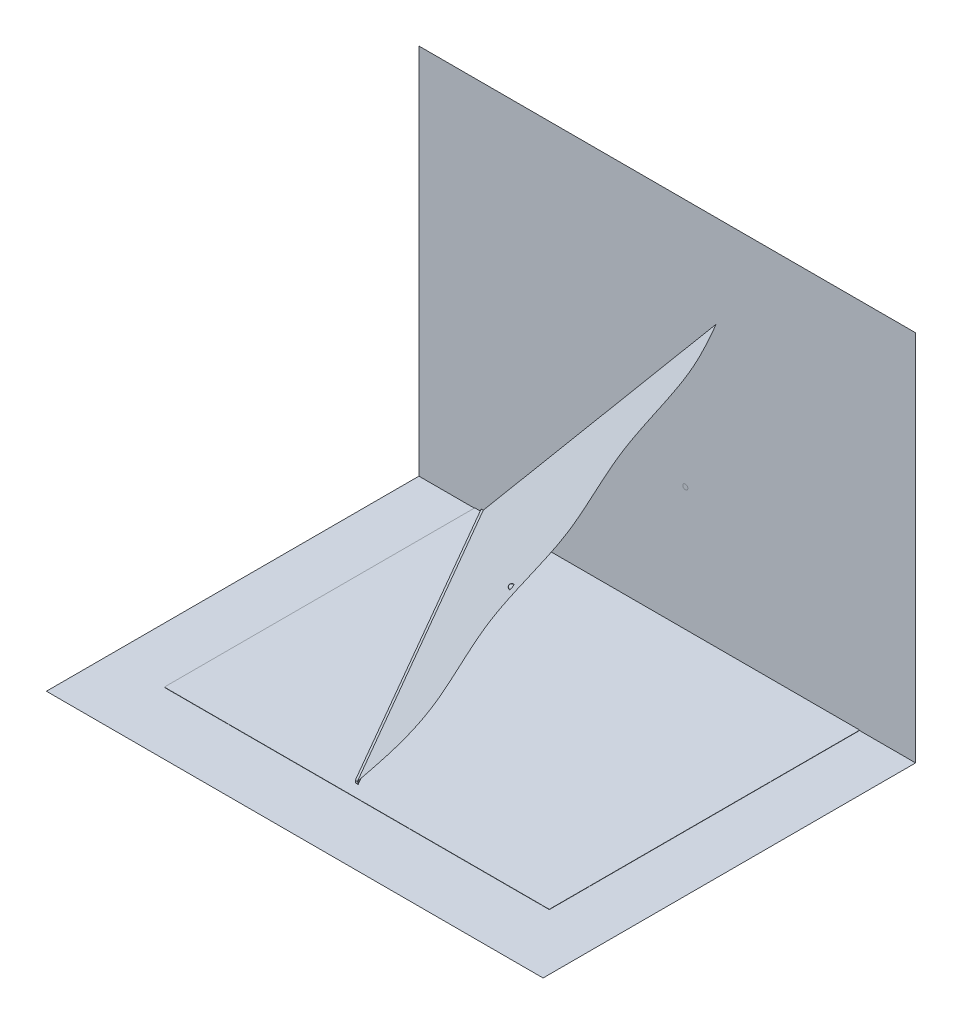
ISO-10303-21;
HEADER;
FILE_DESCRIPTION(('STEP AP214'),'2;1');
FILE_NAME('part.step','',(''),(''),'','','');
FILE_SCHEMA(('AUTOMOTIVE_DESIGN { 1 0 10303 214 1 1 1 1 }'));
ENDSEC;
DATA;
#1=APPLICATION_CONTEXT('core data for automotive mechanical design processes');
#2=APPLICATION_PROTOCOL_DEFINITION('international standard','automotive_design',2000,#1);
#3=PRODUCT_CONTEXT('',#1,'mechanical');
#4=PRODUCT('Part','Part','',(#3));
#5=PRODUCT_RELATED_PRODUCT_CATEGORY('part','',(#4));
#6=PRODUCT_DEFINITION_FORMATION('','',#4);
#7=PRODUCT_DEFINITION_CONTEXT('part definition',#1,'design');
#8=PRODUCT_DEFINITION('design','',#6,#7);
#9=PRODUCT_DEFINITION_SHAPE('','',#8);
#10=(LENGTH_UNIT() NAMED_UNIT(*) SI_UNIT(.MILLI.,.METRE.));
#11=(NAMED_UNIT(*) PLANE_ANGLE_UNIT() SI_UNIT($,.RADIAN.));
#12=(NAMED_UNIT(*) SI_UNIT($,.STERADIAN.) SOLID_ANGLE_UNIT());
#13=UNCERTAINTY_MEASURE_WITH_UNIT(LENGTH_MEASURE(1.E-05),#10,'distance_accuracy_value','');
#14=(GEOMETRIC_REPRESENTATION_CONTEXT(3) GLOBAL_UNCERTAINTY_ASSIGNED_CONTEXT((#13)) GLOBAL_UNIT_ASSIGNED_CONTEXT((#10,
#11,#12)) REPRESENTATION_CONTEXT('',''));
#15=CARTESIAN_POINT('',(0.,0.,0.));
#16=DIRECTION('',(0.,0.,1.));
#17=DIRECTION('',(1.,0.,0.));
#18=AXIS2_PLACEMENT_3D('',#15,#16,#17);
#19=CARTESIAN_POINT('',(77.5,0.1,0.));
#20=DIRECTION('',(0.,0.,1.));
#21=DIRECTION('',(1.,0.,0.));
#22=AXIS2_PLACEMENT_3D('',#19,#20,#21);
#23=PLANE('',#22);
#24=CARTESIAN_POINT('',(-77.5,0.2,0.));
#25=CARTESIAN_POINT('',(-71.0416666666666,0.2,0.));
#26=CARTESIAN_POINT('',(-64.5833333333333,0.2,0.));
#27=CARTESIAN_POINT('',(-51.6666666666667,0.2,0.));
#28=CARTESIAN_POINT('',(-45.2083333333333,0.2,0.));
#29=CARTESIAN_POINT('',(-32.2916666666667,0.2,0.));
#30=CARTESIAN_POINT('',(-25.8333333333333,0.2,0.));
#31=CARTESIAN_POINT('',(-12.9166666666667,0.2,0.));
#32=CARTESIAN_POINT('',(-6.45833333333334,0.2,0.));
#33=CARTESIAN_POINT('',(6.45833333333333,0.2,0.));
#34=CARTESIAN_POINT('',(12.9166666666667,0.2,0.));
#35=CARTESIAN_POINT('',(25.8333333333333,0.2,0.));
#36=CARTESIAN_POINT('',(32.2916666666667,0.2,0.));
#37=CARTESIAN_POINT('',(45.2083333333333,0.2,0.));
#38=CARTESIAN_POINT('',(51.6666666666667,0.2,0.));
#39=CARTESIAN_POINT('',(64.5833333333333,0.2,0.));
#40=CARTESIAN_POINT('',(71.0416666666667,0.2,0.));
#41=CARTESIAN_POINT('',(77.5,0.2,0.));
#42=B_SPLINE_CURVE_WITH_KNOTS('',3,(#24,#25,#26,#27,#28,#29,#30,#31,#32,#33,#34,#35,#36,#37,#38,
#39,#40,#41),.UNSPECIFIED.,.F.,.F.,(4,2,2,2,2,2,2,2,4),(0.,19.375,38.75,58.125,77.5,96.875,
116.25,135.625,155.),.UNSPECIFIED.);
#43=CARTESIAN_POINT('',(-74.9160900368823,0.2,0.));
#44=VERTEX_POINT('',#43);
#45=CARTESIAN_POINT('',(-77.5,0.2,0.));
#46=VERTEX_POINT('',#45);
#47=EDGE_CURVE('E205',#44,#46,#42,.F.);
#48=ORIENTED_EDGE('',*,*,#47,.F.);
#49=DIRECTION('',(0.,-1.,0.));
#50=VECTOR('',#49,1.);
#51=CARTESIAN_POINT('',(-74.9160900368823,1.1,0.));
#52=LINE('',#51,#50);
#53=CARTESIAN_POINT('',(-74.9160900368823,1.1,0.));
#54=VERTEX_POINT('',#53);
#55=EDGE_CURVE('E143',#54,#44,#52,.T.);
#56=ORIENTED_EDGE('',*,*,#55,.F.);
#57=DIRECTION('',(1.,0.,0.));
#58=VECTOR('',#57,1.);
#59=CARTESIAN_POINT('',(-74.9160900368823,1.1,0.));
#60=LINE('',#59,#58);
#61=CARTESIAN_POINT('',(-73.7613894985177,1.1,0.));
#62=VERTEX_POINT('',#61);
#63=EDGE_CURVE('E154',#54,#62,#60,.T.);
#64=ORIENTED_EDGE('',*,*,#63,.T.);
#65=DIRECTION('',(0.,-1.,0.));
#66=VECTOR('',#65,1.);
#67=CARTESIAN_POINT('',(-73.7613894985177,1.1,0.));
#68=LINE('',#67,#66);
#69=CARTESIAN_POINT('',(-73.7613894985178,0.2,0.));
#70=VERTEX_POINT('',#69);
#71=EDGE_CURVE('E164',#62,#70,#68,.T.);
#72=ORIENTED_EDGE('',*,*,#71,.T.);
#73=CARTESIAN_POINT('',(77.5,0.2,0.));
#74=VERTEX_POINT('',#73);
#75=EDGE_CURVE('E203',#74,#70,#42,.F.);
#76=ORIENTED_EDGE('',*,*,#75,.F.);
#77=DIRECTION('',(0.,1.,0.));
#78=VECTOR('',#77,1.);
#79=CARTESIAN_POINT('',(77.5,0.1,0.));
#80=LINE('',#79,#78);
#81=CARTESIAN_POINT('',(77.5,0.1,0.));
#82=VERTEX_POINT('',#81);
#83=EDGE_CURVE('E14',#82,#74,#80,.T.);
#84=ORIENTED_EDGE('',*,*,#83,.F.);
#85=DIRECTION('',(-1.,0.,0.));
#86=VECTOR('',#85,1.);
#87=CARTESIAN_POINT('',(0.,0.1,0.));
#88=LINE('',#87,#86);
#89=CARTESIAN_POINT('',(-77.5,0.1,0.));
#90=VERTEX_POINT('',#89);
#91=EDGE_CURVE('E229',#82,#90,#88,.T.);
#92=ORIENTED_EDGE('',*,*,#91,.T.);
#93=DIRECTION('',(0.,1.,0.));
#94=VECTOR('',#93,1.);
#95=CARTESIAN_POINT('',(-77.5,0.1,0.));
#96=LINE('',#95,#94);
#97=EDGE_CURVE('E80',#90,#46,#96,.T.);
#98=ORIENTED_EDGE('',*,*,#97,.T.);
#99=EDGE_LOOP('',(#48,#56,#64,#72,#76,#84,#92,#98));
#100=FACE_BOUND('',#99,.T.);
#101=ADVANCED_FACE('F71',(#100),#23,.F.);
#102=CARTESIAN_POINT('',(-77.5,0.1,0.));
#103=DIRECTION('',(1.,0.,0.));
#104=DIRECTION('',(0.,0.,-1.));
#105=AXIS2_PLACEMENT_3D('',#102,#103,#104);
#106=PLANE('',#105);
#107=ORIENTED_EDGE('',*,*,#97,.F.);
#108=DIRECTION('',(0.,0.,1.));
#109=VECTOR('',#108,1.);
#110=CARTESIAN_POINT('',(-77.5,0.1,62.5));
#111=LINE('',#110,#109);
#112=CARTESIAN_POINT('',(-77.5,0.1,125.));
#113=VERTEX_POINT('',#112);
#114=EDGE_CURVE('E75',#90,#113,#111,.T.);
#115=ORIENTED_EDGE('',*,*,#114,.T.);
#116=DIRECTION('',(0.,1.,0.));
#117=VECTOR('',#116,1.);
#118=CARTESIAN_POINT('',(-77.5,0.1,125.));
#119=LINE('',#118,#117);
#120=CARTESIAN_POINT('',(-77.5,0.2,125.));
#121=VERTEX_POINT('',#120);
#122=EDGE_CURVE('E214',#113,#121,#119,.T.);
#123=ORIENTED_EDGE('',*,*,#122,.T.);
#124=CARTESIAN_POINT('',(-77.5,0.2,125.));
#125=CARTESIAN_POINT('',(-77.5,0.2,119.791666666667));
#126=CARTESIAN_POINT('',(-77.5,0.2,114.583333333333));
#127=CARTESIAN_POINT('',(-77.5,0.2,104.166666666667));
#128=CARTESIAN_POINT('',(-77.5,0.2,98.9583333333333));
#129=CARTESIAN_POINT('',(-77.5,0.2,88.5416666666666));
#130=CARTESIAN_POINT('',(-77.5,0.2,83.3333333333333));
#131=CARTESIAN_POINT('',(-77.5,0.2,72.9166666666667));
#132=CARTESIAN_POINT('',(-77.5,0.2,67.7083333333333));
#133=CARTESIAN_POINT('',(-77.5,0.2,57.2916666666666));
#134=CARTESIAN_POINT('',(-77.5,0.2,52.0833333333333));
#135=CARTESIAN_POINT('',(-77.5,0.2,41.6666666666666));
#136=CARTESIAN_POINT('',(-77.5,0.2,36.4583333333333));
#137=CARTESIAN_POINT('',(-77.5,0.2,26.0416666666666));
#138=CARTESIAN_POINT('',(-77.5,0.2,20.8333333333333));
#139=CARTESIAN_POINT('',(-77.5,0.2,10.4166666666666));
#140=CARTESIAN_POINT('',(-77.5,0.2,5.20833333333332));
#141=CARTESIAN_POINT('',(-77.5,0.2,0.));
#142=B_SPLINE_CURVE_WITH_KNOTS('',3,(#124,#125,#126,#127,#128,#129,#130,#131,#132,#133,#134,
#135,#136,#137,#138,#139,#140,#141),.UNSPECIFIED.,.F.,.F.,(4,2,2,2,2,2,2,2,4),(0.,15.625,31.25,
46.875,62.5,78.125,93.75,109.375,125.),.UNSPECIFIED.);
#143=EDGE_CURVE('E179',#46,#121,#142,.F.);
#144=ORIENTED_EDGE('',*,*,#143,.F.);
#145=EDGE_LOOP('',(#107,#115,#123,#144));
#146=FACE_BOUND('',#145,.T.);
#147=ADVANCED_FACE('F237',(#146),#106,.F.);
#148=CARTESIAN_POINT('',(-77.5,0.1,125.));
#149=DIRECTION('',(0.,0.,1.));
#150=DIRECTION('',(1.,0.,0.));
#151=AXIS2_PLACEMENT_3D('',#148,#149,#150);
#152=PLANE('',#151);
#153=ORIENTED_EDGE('',*,*,#122,.F.);
#154=DIRECTION('',(1.,0.,0.));
#155=VECTOR('',#154,1.);
#156=CARTESIAN_POINT('',(0.,0.1,125.));
#157=LINE('',#156,#155);
#158=CARTESIAN_POINT('',(77.5,0.1,125.));
#159=VERTEX_POINT('',#158);
#160=EDGE_CURVE('E224',#113,#159,#157,.T.);
#161=ORIENTED_EDGE('',*,*,#160,.T.);
#162=DIRECTION('',(0.,1.,0.));
#163=VECTOR('',#162,1.);
#164=CARTESIAN_POINT('',(77.5,0.1,125.));
#165=LINE('',#164,#163);
#166=CARTESIAN_POINT('',(77.5,0.2,125.));
#167=VERTEX_POINT('',#166);
#168=EDGE_CURVE('E177',#159,#167,#165,.T.);
#169=ORIENTED_EDGE('',*,*,#168,.T.);
#170=CARTESIAN_POINT('',(-77.5,0.2,125.));
#171=CARTESIAN_POINT('',(-71.0416666666666,0.2,125.));
#172=CARTESIAN_POINT('',(-64.5833333333333,0.2,125.));
#173=CARTESIAN_POINT('',(-51.6666666666667,0.2,125.));
#174=CARTESIAN_POINT('',(-45.2083333333333,0.2,125.));
#175=CARTESIAN_POINT('',(-32.2916666666667,0.2,125.));
#176=CARTESIAN_POINT('',(-25.8333333333333,0.2,125.));
#177=CARTESIAN_POINT('',(-12.9166666666667,0.2,125.));
#178=CARTESIAN_POINT('',(-6.45833333333334,0.2,125.));
#179=CARTESIAN_POINT('',(6.45833333333333,0.2,125.));
#180=CARTESIAN_POINT('',(12.9166666666667,0.2,125.));
#181=CARTESIAN_POINT('',(25.8333333333333,0.2,125.));
#182=CARTESIAN_POINT('',(32.2916666666667,0.2,125.));
#183=CARTESIAN_POINT('',(45.2083333333333,0.2,125.));
#184=CARTESIAN_POINT('',(51.6666666666667,0.2,125.));
#185=CARTESIAN_POINT('',(64.5833333333333,0.2,125.));
#186=CARTESIAN_POINT('',(71.0416666666667,0.2,125.));
#187=CARTESIAN_POINT('',(77.5,0.2,125.));
#188=B_SPLINE_CURVE_WITH_KNOTS('',3,(#170,#171,#172,#173,#174,#175,#176,#177,#178,#179,#180,
#181,#182,#183,#184,#185,#186,#187),.UNSPECIFIED.,.F.,.F.,(4,2,2,2,2,2,2,2,4),(0.,19.375,38.75,
58.125,77.5,96.875,116.25,135.625,155.),.UNSPECIFIED.);
#189=EDGE_CURVE('E172',#121,#167,#188,.T.);
#190=ORIENTED_EDGE('',*,*,#189,.F.);
#191=EDGE_LOOP('',(#153,#161,#169,#190));
#192=FACE_BOUND('',#191,.T.);
#193=ADVANCED_FACE('F193',(#192),#152,.T.);
#194=CARTESIAN_POINT('',(77.5,0.1,125.));
#195=DIRECTION('',(1.,0.,0.));
#196=DIRECTION('',(0.,0.,-1.));
#197=AXIS2_PLACEMENT_3D('',#194,#195,#196);
#198=PLANE('',#197);
#199=DIRECTION('',(0.,0.,-1.));
#200=VECTOR('',#199,1.);
#201=CARTESIAN_POINT('',(77.5,0.1,62.5));
#202=LINE('',#201,#200);
#203=EDGE_CURVE('E227',#159,#82,#202,.T.);
#204=ORIENTED_EDGE('',*,*,#203,.T.);
#205=ORIENTED_EDGE('',*,*,#83,.T.);
#206=CARTESIAN_POINT('',(77.5,0.2,125.));
#207=CARTESIAN_POINT('',(77.5,0.2,119.791666666667));
#208=CARTESIAN_POINT('',(77.5,0.2,114.583333333333));
#209=CARTESIAN_POINT('',(77.5,0.2,104.166666666667));
#210=CARTESIAN_POINT('',(77.5,0.2,98.9583333333333));
#211=CARTESIAN_POINT('',(77.5,0.2,88.5416666666666));
#212=CARTESIAN_POINT('',(77.5,0.2,83.3333333333333));
#213=CARTESIAN_POINT('',(77.5,0.2,72.9166666666667));
#214=CARTESIAN_POINT('',(77.5,0.2,67.7083333333333));
#215=CARTESIAN_POINT('',(77.5,0.2,57.2916666666666));
#216=CARTESIAN_POINT('',(77.5,0.2,52.0833333333333));
#217=CARTESIAN_POINT('',(77.5,0.2,41.6666666666666));
#218=CARTESIAN_POINT('',(77.5,0.2,36.4583333333333));
#219=CARTESIAN_POINT('',(77.5,0.2,26.0416666666666));
#220=CARTESIAN_POINT('',(77.5,0.2,20.8333333333333));
#221=CARTESIAN_POINT('',(77.5,0.2,10.4166666666666));
#222=CARTESIAN_POINT('',(77.5,0.2,5.20833333333332));
#223=CARTESIAN_POINT('',(77.5,0.2,0.));
#224=B_SPLINE_CURVE_WITH_KNOTS('',3,(#206,#207,#208,#209,#210,#211,#212,#213,#214,#215,#216,
#217,#218,#219,#220,#221,#222,#223),.UNSPECIFIED.,.F.,.F.,(4,2,2,2,2,2,2,2,4),(0.,15.625,31.25,
46.875,62.5,78.125,93.75,109.375,125.),.UNSPECIFIED.);
#225=EDGE_CURVE('E178',#167,#74,#224,.T.);
#226=ORIENTED_EDGE('',*,*,#225,.F.);
#227=ORIENTED_EDGE('',*,*,#168,.F.);
#228=EDGE_LOOP('',(#204,#205,#226,#227));
#229=FACE_BOUND('',#228,.T.);
#230=ADVANCED_FACE('F192',(#229),#198,.T.);
#231=CARTESIAN_POINT('',(-77.5,0.1,125.));
#232=CARTESIAN_POINT('',(-77.5,0.1,83.3333333333333));
#233=CARTESIAN_POINT('',(-77.5,0.1,41.6666666666666));
#234=CARTESIAN_POINT('',(-77.5,0.1,0.));
#235=CARTESIAN_POINT('',(-25.8333333333333,0.1,125.));
#236=CARTESIAN_POINT('',(-25.8333333333333,0.1,83.3333333333333));
#237=CARTESIAN_POINT('',(-25.8333333333333,0.1,41.6666666666666));
#238=CARTESIAN_POINT('',(-25.8333333333333,0.1,0.));
#239=CARTESIAN_POINT('',(25.8333333333333,0.1,125.));
#240=CARTESIAN_POINT('',(25.8333333333333,0.1,83.3333333333333));
#241=CARTESIAN_POINT('',(25.8333333333333,0.1,41.6666666666666));
#242=CARTESIAN_POINT('',(25.8333333333333,0.1,0.));
#243=CARTESIAN_POINT('',(77.5,0.1,125.));
#244=CARTESIAN_POINT('',(77.5,0.1,83.3333333333333));
#245=CARTESIAN_POINT('',(77.5,0.1,41.6666666666666));
#246=CARTESIAN_POINT('',(77.5,0.1,0.));
#247=B_SPLINE_SURFACE_WITH_KNOTS('',3,3,((#231,#232,#233,#234),(#235,#236,#237,#238),(#239,#240,
#241,#242),(#243,#244,#245,#246)),.UNSPECIFIED.,.F.,.F.,.F.,(4,4),(4,4),(0.,1.),(0.,1.),.UNSPECIFIED.);
#248=OFFSET_SURFACE('',#247,0.1,.F.);
#249=DIRECTION('',(-0.499999999980915,0.,-0.866025403795457));
#250=VECTOR('',#249,1.);
#251=CARTESIAN_POINT('',(-28.257748257721,0.2,78.8146185624576));
#252=LINE('',#251,#250);
#253=CARTESIAN_POINT('',(-4.50534231820627,0.2,119.954992453792));
#254=VERTEX_POINT('',#253);
#255=EDGE_CURVE('E88',#254,#70,#252,.T.);
#256=ORIENTED_EDGE('',*,*,#255,.F.);
#257=DIRECTION('',(1.,0.,0.));
#258=VECTOR('',#257,1.);
#259=CARTESIAN_POINT('',(0.,0.2,119.954992453792));
#260=LINE('',#259,#258);
#261=CARTESIAN_POINT('',(-5.66004285657083,0.2,119.954992453792));
#262=VERTEX_POINT('',#261);
#263=EDGE_CURVE('E170',#262,#254,#260,.T.);
#264=ORIENTED_EDGE('',*,*,#263,.F.);
#265=DIRECTION('',(0.499999999980915,0.,0.866025403795457));
#266=VECTOR('',#265,1.);
#267=CARTESIAN_POINT('',(-29.1237736615165,0.2,79.3146185624385));
#268=LINE('',#267,#266);
#269=EDGE_CURVE('E94',#44,#262,#268,.T.);
#270=ORIENTED_EDGE('',*,*,#269,.F.);
#271=ORIENTED_EDGE('',*,*,#47,.T.);
#272=ORIENTED_EDGE('',*,*,#143,.T.);
#273=ORIENTED_EDGE('',*,*,#189,.T.);
#274=ORIENTED_EDGE('',*,*,#225,.T.);
#275=ORIENTED_EDGE('',*,*,#75,.T.);
#276=EDGE_LOOP('',(#256,#264,#270,#271,#272,#273,#274,#275));
#277=FACE_BOUND('',#276,.T.);
#278=ADVANCED_FACE('F182',(#277),#248,.T.);
#279=CARTESIAN_POINT('',(-77.5,0.1,125.));
#280=DIRECTION('',(0.,1.,0.));
#281=DIRECTION('',(1.,0.,0.));
#282=AXIS2_PLACEMENT_3D('',#279,#280,#281);
#283=PLANE('',#282);
#284=ORIENTED_EDGE('',*,*,#114,.F.);
#285=ORIENTED_EDGE('',*,*,#91,.F.);
#286=ORIENTED_EDGE('',*,*,#203,.F.);
#287=ORIENTED_EDGE('',*,*,#160,.F.);
#288=EDGE_LOOP('',(#284,#285,#286,#287));
#289=FACE_BOUND('',#288,.T.);
#290=ADVANCED_FACE('F73',(#289),#283,.F.);
#291=CARTESIAN_POINT('',(-5.66004285657083,1.1,119.954992453792));
#292=DIRECTION('',(0.,0.,1.));
#293=DIRECTION('',(1.,0.,0.));
#294=AXIS2_PLACEMENT_3D('',#291,#292,#293);
#295=PLANE('',#294);
#296=DIRECTION('',(0.,-1.,0.));
#297=VECTOR('',#296,1.);
#298=CARTESIAN_POINT('',(-5.66004285657083,1.1,119.954992453792));
#299=LINE('',#298,#297);
#300=CARTESIAN_POINT('',(-5.66004285657083,1.1,119.954992453792));
#301=VERTEX_POINT('',#300);
#302=EDGE_CURVE('E136',#301,#262,#299,.T.);
#303=ORIENTED_EDGE('',*,*,#302,.T.);
#304=ORIENTED_EDGE('',*,*,#263,.T.);
#305=DIRECTION('',(0.,-1.,0.));
#306=VECTOR('',#305,1.);
#307=CARTESIAN_POINT('',(-4.50534231820627,1.1,119.954992453792));
#308=LINE('',#307,#306);
#309=CARTESIAN_POINT('',(-4.50534231820627,1.1,119.954992453792));
#310=VERTEX_POINT('',#309);
#311=EDGE_CURVE('E158',#310,#254,#308,.T.);
#312=ORIENTED_EDGE('',*,*,#311,.F.);
#313=DIRECTION('',(-1.,0.,0.));
#314=VECTOR('',#313,1.);
#315=CARTESIAN_POINT('',(-5.66004285657083,1.1,119.954992453792));
#316=LINE('',#315,#314);
#317=EDGE_CURVE('E151',#310,#301,#316,.T.);
#318=ORIENTED_EDGE('',*,*,#317,.T.);
#319=EDGE_LOOP('',(#303,#304,#312,#318));
#320=FACE_BOUND('',#319,.T.);
#321=ADVANCED_FACE('F156',(#320),#295,.T.);
#322=CARTESIAN_POINT('',(-4.50534231820627,1.1,119.954992453792));
#323=DIRECTION('',(0.866025403795458,0.,-0.499999999980915));
#324=DIRECTION('',(-0.499999999980915,0.,-0.866025403795457));
#325=AXIS2_PLACEMENT_3D('',#322,#323,#324);
#326=PLANE('',#325);
#327=ORIENTED_EDGE('',*,*,#311,.T.);
#328=ORIENTED_EDGE('',*,*,#255,.T.);
#329=ORIENTED_EDGE('',*,*,#71,.F.);
#330=DIRECTION('',(0.499999999980915,0.,0.866025403795457));
#331=VECTOR('',#330,1.);
#332=CARTESIAN_POINT('',(-4.50534231820627,1.1,119.954992453792));
#333=LINE('',#332,#331);
#334=EDGE_CURVE('E144',#62,#310,#333,.T.);
#335=ORIENTED_EDGE('',*,*,#334,.T.);
#336=EDGE_LOOP('',(#327,#328,#329,#335));
#337=FACE_BOUND('',#336,.T.);
#338=ADVANCED_FACE('F260',(#337),#326,.T.);
#339=CARTESIAN_POINT('',(-5.66004285657083,1.1,119.954992453792));
#340=DIRECTION('',(-0.866025403795457,0.,0.499999999980915));
#341=DIRECTION('',(0.499999999980915,0.,0.866025403795457));
#342=AXIS2_PLACEMENT_3D('',#339,#340,#341);
#343=PLANE('',#342);
#344=ORIENTED_EDGE('',*,*,#55,.T.);
#345=ORIENTED_EDGE('',*,*,#269,.T.);
#346=ORIENTED_EDGE('',*,*,#302,.F.);
#347=DIRECTION('',(-0.499999999980915,0.,-0.866025403795457));
#348=VECTOR('',#347,1.);
#349=CARTESIAN_POINT('',(-5.66004285657083,1.1,119.954992453792));
#350=LINE('',#349,#348);
#351=EDGE_CURVE('E140',#301,#54,#350,.T.);
#352=ORIENTED_EDGE('',*,*,#351,.T.);
#353=EDGE_LOOP('',(#344,#345,#346,#352));
#354=FACE_BOUND('',#353,.T.);
#355=ADVANCED_FACE('F139',(#354),#343,.T.);
#356=CARTESIAN_POINT('',(-4.50534231820627,1.1,119.954992453792));
#357=DIRECTION('',(0.,1.,0.));
#358=DIRECTION('',(0.,0.,1.));
#359=AXIS2_PLACEMENT_3D('',#356,#357,#358);
#360=PLANE('',#359);
#361=ORIENTED_EDGE('',*,*,#317,.F.);
#362=ORIENTED_EDGE('',*,*,#334,.F.);
#363=ORIENTED_EDGE('',*,*,#63,.F.);
#364=ORIENTED_EDGE('',*,*,#351,.F.);
#365=EDGE_LOOP('',(#361,#362,#363,#364));
#366=FACE_BOUND('',#365,.T.);
#367=ADVANCED_FACE('F149',(#366),#360,.T.);
#368=CLOSED_SHELL('',(#101,#147,#193,#230,#278,#290,#321,#338,#355,#367));
#369=MANIFOLD_SOLID_BREP('B2',#368);
#370=CARTESIAN_POINT('',(7.36950040213743,0.0999,70.));
#371=DIRECTION('',(0.,1.,0.));
#372=DIRECTION('',(0.,0.,1.));
#373=AXIS2_PLACEMENT_3D('',#370,#371,#372);
#374=CYLINDRICAL_SURFACE('',#373,1.);
#375=CARTESIAN_POINT('',(7.36950040213743,0.0999,70.));
#376=DIRECTION('',(0.,1.,0.));
#377=DIRECTION('',(0.,0.,1.));
#378=AXIS2_PLACEMENT_3D('',#375,#376,#377);
#379=CIRCLE('',#378,1.);
#380=CARTESIAN_POINT('',(7.36950040213743,0.0999,71.));
#381=VERTEX_POINT('',#380);
#382=EDGE_CURVE('E70',#381,#381,#379,.T.);
#383=ORIENTED_EDGE('',*,*,#382,.T.);
#384=EDGE_LOOP('',(#383));
#385=FACE_BOUND('',#384,.T.);
#386=CARTESIAN_POINT('',(7.36950040213743,0.1,70.));
#387=DIRECTION('',(0.,1.,0.));
#388=DIRECTION('',(0.,0.,1.));
#389=AXIS2_PLACEMENT_3D('',#386,#387,#388);
#390=CIRCLE('',#389,1.);
#391=CARTESIAN_POINT('',(7.36950040213743,0.1,71.));
#392=VERTEX_POINT('',#391);
#393=EDGE_CURVE('E331',#392,#392,#390,.T.);
#394=ORIENTED_EDGE('',*,*,#393,.F.);
#395=EDGE_LOOP('',(#394));
#396=FACE_BOUND('',#395,.T.);
#397=ADVANCED_FACE('F325',(#385,#396),#374,.T.);
#398=CARTESIAN_POINT('',(7.36950040213743,0.0999,70.));
#399=DIRECTION('',(0.,1.,0.));
#400=DIRECTION('',(0.,0.,1.));
#401=AXIS2_PLACEMENT_3D('',#398,#399,#400);
#402=PLANE('',#401);
#403=ORIENTED_EDGE('',*,*,#382,.F.);
#404=EDGE_LOOP('',(#403));
#405=FACE_BOUND('',#404,.T.);
#406=ADVANCED_FACE('F340',(#405),#402,.F.);
#407=CARTESIAN_POINT('',(7.36950040213743,0.1,70.));
#408=DIRECTION('',(0.,1.,0.));
#409=DIRECTION('',(0.,0.,1.));
#410=AXIS2_PLACEMENT_3D('',#407,#408,#409);
#411=PLANE('',#410);
#412=ORIENTED_EDGE('',*,*,#393,.T.);
#413=EDGE_LOOP('',(#412));
#414=FACE_BOUND('',#413,.T.);
#415=ADVANCED_FACE('F337',(#414),#411,.T.);
#416=CLOSED_SHELL('',(#397,#406,#415));
#417=MANIFOLD_SOLID_BREP('B8',#416);
#418=CARTESIAN_POINT('',(7.36950040213743,50.,0.0999));
#419=DIRECTION('',(0.,0.,1.));
#420=DIRECTION('',(1.,0.,0.));
#421=AXIS2_PLACEMENT_3D('',#418,#419,#420);
#422=CYLINDRICAL_SURFACE('',#421,1.);
#423=CARTESIAN_POINT('',(7.36950040213743,50.,0.0999));
#424=DIRECTION('',(0.,0.,1.));
#425=DIRECTION('',(1.,0.,0.));
#426=AXIS2_PLACEMENT_3D('',#423,#424,#425);
#427=CIRCLE('',#426,1.);
#428=CARTESIAN_POINT('',(8.36950040213743,50.,0.0999));
#429=VERTEX_POINT('',#428);
#430=EDGE_CURVE('E324',#429,#429,#427,.T.);
#431=ORIENTED_EDGE('',*,*,#430,.T.);
#432=EDGE_LOOP('',(#431));
#433=FACE_BOUND('',#432,.T.);
#434=CARTESIAN_POINT('',(7.36950040213743,50.,0.1));
#435=DIRECTION('',(0.,0.,1.));
#436=DIRECTION('',(1.,0.,0.));
#437=AXIS2_PLACEMENT_3D('',#434,#435,#436);
#438=CIRCLE('',#437,1.);
#439=CARTESIAN_POINT('',(8.36950040213743,50.,0.1));
#440=VERTEX_POINT('',#439);
#441=EDGE_CURVE('E371',#440,#440,#438,.T.);
#442=ORIENTED_EDGE('',*,*,#441,.F.);
#443=EDGE_LOOP('',(#442));
#444=FACE_BOUND('',#443,.T.);
#445=ADVANCED_FACE('F365',(#433,#444),#422,.T.);
#446=CARTESIAN_POINT('',(7.36950040213743,50.,0.0999));
#447=DIRECTION('',(0.,0.,1.));
#448=DIRECTION('',(1.,0.,0.));
#449=AXIS2_PLACEMENT_3D('',#446,#447,#448);
#450=PLANE('',#449);
#451=ORIENTED_EDGE('',*,*,#430,.F.);
#452=EDGE_LOOP('',(#451));
#453=FACE_BOUND('',#452,.T.);
#454=ADVANCED_FACE('F380',(#453),#450,.F.);
#455=CARTESIAN_POINT('',(7.36950040213743,50.,0.1));
#456=DIRECTION('',(0.,0.,1.));
#457=DIRECTION('',(1.,0.,0.));
#458=AXIS2_PLACEMENT_3D('',#455,#456,#457);
#459=PLANE('',#458);
#460=ORIENTED_EDGE('',*,*,#441,.T.);
#461=EDGE_LOOP('',(#460));
#462=FACE_BOUND('',#461,.T.);
#463=ADVANCED_FACE('F377',(#462),#459,.T.);
#464=CLOSED_SHELL('',(#445,#454,#463));
#465=MANIFOLD_SOLID_BREP('B65',#464);
#466=CARTESIAN_POINT('',(7.36950040213743,50.,70.));
#467=DIRECTION('',(0.,1.,0.));
#468=DIRECTION('',(1.,0.,0.));
#469=AXIS2_PLACEMENT_3D('',#466,#467,#468);
#470=SPHERICAL_SURFACE('',#469,1.);
#471=CARTESIAN_POINT('',(7.36950040213743,51.,70.));
#472=VERTEX_POINT('',#471);
#473=VERTEX_LOOP('',#472);
#474=FACE_BOUND('',#473,.T.);
#475=ADVANCED_FACE('F409',(#474),#470,.T.);
#476=CLOSED_SHELL('',(#475));
#477=MANIFOLD_SOLID_BREP('B319',#476);
#478=CARTESIAN_POINT('',(-94.6527099200424,-77.2097390588701,78.1743008640143));
#479=DIRECTION('',(-0.700582935935479,0.587858883152554,0.404481746652005));
#480=DIRECTION('',(-0.642787609686538,-0.766044443118979,0.));
#481=AXIS2_PLACEMENT_3D('',#478,#479,#480);
#482=PLANE('',#481);
#483=DIRECTION('',(0.642787609686538,0.766044443118979,0.));
#484=VECTOR('',#483,1.);
#485=CARTESIAN_POINT('',(-75.,0.,0.));
#486=LINE('',#485,#484);
#487=CARTESIAN_POINT('',(-75.,0.,0.));
#488=VERTEX_POINT('',#487);
#489=CARTESIAN_POINT('',(19.7439193505859,112.911406262517,0.));
#490=VERTEX_POINT('',#489);
#491=EDGE_CURVE('E437',#488,#490,#486,.T.);
#492=ORIENTED_EDGE('',*,*,#491,.F.);
#493=DIRECTION('',(0.499999999999998,0.,0.86602540378444));
#494=VECTOR('',#493,1.);
#495=CARTESIAN_POINT('',(-75.,0.,0.));
#496=LINE('',#495,#494);
#497=CARTESIAN_POINT('',(-5.73946754941219,0.,119.962761163692));
#498=VERTEX_POINT('',#497);
#499=EDGE_CURVE('E407',#488,#498,#496,.T.);
#500=ORIENTED_EDGE('',*,*,#499,.T.);
#501=CARTESIAN_POINT('',(19.7439193505859,112.911406262517,0.));
#502=CARTESIAN_POINT('',(23.6465556366516,112.733096577809,7.01871306378349));
#503=CARTESIAN_POINT('',(33.1499009615178,112.298893033244,24.1100454586161));
#504=CARTESIAN_POINT('',(12.2822723390829,81.8219392142323,32.2603353911205));
#505=CARTESIAN_POINT('',(25.9529564489228,78.5998196135005,60.6215648773496));
#506=CARTESIAN_POINT('',(20.9454555714836,67.6157952137978,67.9120957211331));
#507=CARTESIAN_POINT('',(15.530956180844,57.2453373239783,73.6059494790287));
#508=CARTESIAN_POINT('',(5.26490668727824,40.6830219521006,79.8956897289391));
#509=CARTESIAN_POINT('',(22.4217335146613,35.4564393261553,117.20830830859));
#510=CARTESIAN_POINT('',(4.67950060236853,13.1180311263799,118.943679750666));
#511=CARTESIAN_POINT('',(-5.73946754941219,0.,119.962761163692));
#512=B_SPLINE_CURVE_WITH_KNOTS('',3,(#501,#502,#503,#504,#505,#506,#507,#508,#509,#510,#511),
.UNSPECIFIED.,.F.,.F.,(4,1,1,1,2,1,1,4),(0.,0.112364658733075,0.273620208489284,
0.428886987687706,0.5,0.627410373381897,0.781200062438126,1.),.UNSPECIFIED.);
#513=EDGE_CURVE('E444',#498,#490,#512,.F.);
#514=ORIENTED_EDGE('',*,*,#513,.T.);
#515=EDGE_LOOP('',(#492,#500,#514));
#516=FACE_BOUND('',#515,.T.);
#517=ADVANCED_FACE('F429',(#516),#482,.T.);
#518=OPEN_SHELL('',(#517));
#519=SHELL_BASED_SURFACE_MODEL('B361',(#518));
#520=CARTESIAN_POINT('',(-100.,-0.0001,0.));
#521=DIRECTION('',(-1.,0.,0.));
#522=DIRECTION('',(0.,0.,1.));
#523=AXIS2_PLACEMENT_3D('',#520,#521,#522);
#524=PLANE('',#523);
#525=DIRECTION('',(0.,0.,1.));
#526=VECTOR('',#525,1.);
#527=CARTESIAN_POINT('',(-100.,0.,0.));
#528=LINE('',#527,#526);
#529=CARTESIAN_POINT('',(-100.,0.,0.));
#530=VERTEX_POINT('',#529);
#531=CARTESIAN_POINT('',(-100.,0.,150.));
#532=VERTEX_POINT('',#531);
#533=EDGE_CURVE('E525',#530,#532,#528,.T.);
#534=ORIENTED_EDGE('',*,*,#533,.F.);
#535=DIRECTION('',(0.,1.,0.));
#536=VECTOR('',#535,1.);
#537=CARTESIAN_POINT('',(-100.,-0.0001,0.));
#538=LINE('',#537,#536);
#539=CARTESIAN_POINT('',(-100.,-0.0001,0.));
#540=VERTEX_POINT('',#539);
#541=EDGE_CURVE('E427',#540,#530,#538,.T.);
#542=ORIENTED_EDGE('',*,*,#541,.F.);
#543=DIRECTION('',(0.,0.,1.));
#544=VECTOR('',#543,1.);
#545=CARTESIAN_POINT('',(-100.,-0.0001,0.));
#546=LINE('',#545,#544);
#547=CARTESIAN_POINT('',(-100.,-0.0001,150.));
#548=VERTEX_POINT('',#547);
#549=EDGE_CURVE('E527',#540,#548,#546,.T.);
#550=ORIENTED_EDGE('',*,*,#549,.T.);
#551=DIRECTION('',(0.,1.,0.));
#552=VECTOR('',#551,1.);
#553=CARTESIAN_POINT('',(-100.,-0.0001,150.));
#554=LINE('',#553,#552);
#555=EDGE_CURVE('E488',#548,#532,#554,.T.);
#556=ORIENTED_EDGE('',*,*,#555,.T.);
#557=EDGE_LOOP('',(#534,#542,#550,#556));
#558=FACE_BOUND('',#557,.T.);
#559=ADVANCED_FACE('F485',(#558),#524,.T.);
#560=CARTESIAN_POINT('',(-100.,-0.0001,0.));
#561=DIRECTION('',(0.,0.,-1.));
#562=DIRECTION('',(-1.,0.,0.));
#563=AXIS2_PLACEMENT_3D('',#560,#561,#562);
#564=PLANE('',#563);
#565=DIRECTION('',(-1.,0.,0.));
#566=VECTOR('',#565,1.);
#567=CARTESIAN_POINT('',(-100.,0.,0.));
#568=LINE('',#567,#566);
#569=CARTESIAN_POINT('',(100.,0.,0.));
#570=VERTEX_POINT('',#569);
#571=EDGE_CURVE('E542',#570,#530,#568,.T.);
#572=ORIENTED_EDGE('',*,*,#571,.F.);
#573=DIRECTION('',(0.,1.,0.));
#574=VECTOR('',#573,1.);
#575=CARTESIAN_POINT('',(100.,-0.0001,0.));
#576=LINE('',#575,#574);
#577=CARTESIAN_POINT('',(100.,-0.0001,0.));
#578=VERTEX_POINT('',#577);
#579=EDGE_CURVE('E493',#578,#570,#576,.T.);
#580=ORIENTED_EDGE('',*,*,#579,.F.);
#581=DIRECTION('',(-1.,0.,0.));
#582=VECTOR('',#581,1.);
#583=CARTESIAN_POINT('',(-100.,-0.0001,0.));
#584=LINE('',#583,#582);
#585=EDGE_CURVE('E532',#578,#540,#584,.T.);
#586=ORIENTED_EDGE('',*,*,#585,.T.);
#587=ORIENTED_EDGE('',*,*,#541,.T.);
#588=EDGE_LOOP('',(#572,#580,#586,#587));
#589=FACE_BOUND('',#588,.T.);
#590=ADVANCED_FACE('F557',(#589),#564,.T.);
#591=CARTESIAN_POINT('',(100.,-0.0001,0.));
#592=DIRECTION('',(1.,0.,0.));
#593=DIRECTION('',(0.,0.,-1.));
#594=AXIS2_PLACEMENT_3D('',#591,#592,#593);
#595=PLANE('',#594);
#596=DIRECTION('',(0.,0.,-1.));
#597=VECTOR('',#596,1.);
#598=CARTESIAN_POINT('',(100.,0.,0.));
#599=LINE('',#598,#597);
#600=CARTESIAN_POINT('',(100.,0.,150.));
#601=VERTEX_POINT('',#600);
#602=EDGE_CURVE('E539',#601,#570,#599,.T.);
#603=ORIENTED_EDGE('',*,*,#602,.F.);
#604=DIRECTION('',(0.,1.,0.));
#605=VECTOR('',#604,1.);
#606=CARTESIAN_POINT('',(100.,-0.0001,150.));
#607=LINE('',#606,#605);
#608=CARTESIAN_POINT('',(100.,-0.0001,150.));
#609=VERTEX_POINT('',#608);
#610=EDGE_CURVE('E531',#609,#601,#607,.T.);
#611=ORIENTED_EDGE('',*,*,#610,.F.);
#612=DIRECTION('',(0.,0.,-1.));
#613=VECTOR('',#612,1.);
#614=CARTESIAN_POINT('',(100.,-0.0001,0.));
#615=LINE('',#614,#613);
#616=EDGE_CURVE('E550',#609,#578,#615,.T.);
#617=ORIENTED_EDGE('',*,*,#616,.T.);
#618=ORIENTED_EDGE('',*,*,#579,.T.);
#619=EDGE_LOOP('',(#603,#611,#617,#618));
#620=FACE_BOUND('',#619,.T.);
#621=ADVANCED_FACE('F554',(#620),#595,.T.);
#622=CARTESIAN_POINT('',(-100.,-0.0001,150.));
#623=DIRECTION('',(0.,0.,1.));
#624=DIRECTION('',(1.,0.,0.));
#625=AXIS2_PLACEMENT_3D('',#622,#623,#624);
#626=PLANE('',#625);
#627=DIRECTION('',(1.,0.,0.));
#628=VECTOR('',#627,1.);
#629=CARTESIAN_POINT('',(-100.,0.,150.));
#630=LINE('',#629,#628);
#631=EDGE_CURVE('E534',#532,#601,#630,.T.);
#632=ORIENTED_EDGE('',*,*,#631,.F.);
#633=ORIENTED_EDGE('',*,*,#555,.F.);
#634=DIRECTION('',(1.,0.,0.));
#635=VECTOR('',#634,1.);
#636=CARTESIAN_POINT('',(-100.,-0.0001,150.));
#637=LINE('',#636,#635);
#638=EDGE_CURVE('E548',#548,#609,#637,.T.);
#639=ORIENTED_EDGE('',*,*,#638,.T.);
#640=ORIENTED_EDGE('',*,*,#610,.T.);
#641=EDGE_LOOP('',(#632,#633,#639,#640));
#642=FACE_BOUND('',#641,.T.);
#643=ADVANCED_FACE('F535',(#642),#626,.T.);
#644=CARTESIAN_POINT('',(-100.,-0.0001,150.));
#645=DIRECTION('',(0.,1.,0.));
#646=DIRECTION('',(0.,0.,1.));
#647=AXIS2_PLACEMENT_3D('',#644,#645,#646);
#648=PLANE('',#647);
#649=ORIENTED_EDGE('',*,*,#549,.F.);
#650=ORIENTED_EDGE('',*,*,#585,.F.);
#651=ORIENTED_EDGE('',*,*,#616,.F.);
#652=ORIENTED_EDGE('',*,*,#638,.F.);
#653=EDGE_LOOP('',(#649,#650,#651,#652));
#654=FACE_BOUND('',#653,.T.);
#655=ADVANCED_FACE('F559',(#654),#648,.F.);
#656=CARTESIAN_POINT('',(-100.,0.,150.));
#657=DIRECTION('',(0.,1.,0.));
#658=DIRECTION('',(0.,0.,1.));
#659=AXIS2_PLACEMENT_3D('',#656,#657,#658);
#660=PLANE('',#659);
#661=ORIENTED_EDGE('',*,*,#533,.T.);
#662=ORIENTED_EDGE('',*,*,#631,.T.);
#663=ORIENTED_EDGE('',*,*,#602,.T.);
#664=ORIENTED_EDGE('',*,*,#571,.T.);
#665=EDGE_LOOP('',(#661,#662,#663,#664));
#666=FACE_BOUND('',#665,.T.);
#667=ADVANCED_FACE('F541',(#666),#660,.T.);
#668=CLOSED_SHELL('',(#559,#590,#621,#643,#655,#667));
#669=MANIFOLD_SOLID_BREP('B401',#668);
#670=CARTESIAN_POINT('',(-100.,150.,-0.0001));
#671=DIRECTION('',(-1.,0.,0.));
#672=DIRECTION('',(0.,-1.,0.));
#673=AXIS2_PLACEMENT_3D('',#670,#671,#672);
#674=PLANE('',#673);
#675=DIRECTION('',(0.,-1.,0.));
#676=VECTOR('',#675,1.);
#677=CARTESIAN_POINT('',(-100.,150.,0.));
#678=LINE('',#677,#676);
#679=CARTESIAN_POINT('',(-100.,150.,0.));
#680=VERTEX_POINT('',#679);
#681=CARTESIAN_POINT('',(-100.,0.,0.));
#682=VERTEX_POINT('',#681);
#683=EDGE_CURVE('E636',#680,#682,#678,.T.);
#684=ORIENTED_EDGE('',*,*,#683,.F.);
#685=DIRECTION('',(0.,0.,1.));
#686=VECTOR('',#685,1.);
#687=CARTESIAN_POINT('',(-100.,150.,-0.0001));
#688=LINE('',#687,#686);
#689=CARTESIAN_POINT('',(-100.,150.,-0.0001));
#690=VERTEX_POINT('',#689);
#691=EDGE_CURVE('E483',#690,#680,#688,.T.);
#692=ORIENTED_EDGE('',*,*,#691,.F.);
#693=DIRECTION('',(0.,-1.,0.));
#694=VECTOR('',#693,1.);
#695=CARTESIAN_POINT('',(-100.,150.,-0.0001));
#696=LINE('',#695,#694);
#697=CARTESIAN_POINT('',(-100.,0.,-0.0001));
#698=VERTEX_POINT('',#697);
#699=EDGE_CURVE('E638',#690,#698,#696,.T.);
#700=ORIENTED_EDGE('',*,*,#699,.T.);
#701=DIRECTION('',(0.,0.,1.));
#702=VECTOR('',#701,1.);
#703=CARTESIAN_POINT('',(-100.,0.,-0.0001));
#704=LINE('',#703,#702);
#705=EDGE_CURVE('E599',#698,#682,#704,.T.);
#706=ORIENTED_EDGE('',*,*,#705,.T.);
#707=EDGE_LOOP('',(#684,#692,#700,#706));
#708=FACE_BOUND('',#707,.T.);
#709=ADVANCED_FACE('F596',(#708),#674,.T.);
#710=CARTESIAN_POINT('',(-100.,150.,-0.0001));
#711=DIRECTION('',(0.,1.,0.));
#712=DIRECTION('',(0.,0.,1.));
#713=AXIS2_PLACEMENT_3D('',#710,#711,#712);
#714=PLANE('',#713);
#715=DIRECTION('',(-1.,0.,0.));
#716=VECTOR('',#715,1.);
#717=CARTESIAN_POINT('',(-100.,150.,0.));
#718=LINE('',#717,#716);
#719=CARTESIAN_POINT('',(100.,150.,0.));
#720=VERTEX_POINT('',#719);
#721=EDGE_CURVE('E653',#720,#680,#718,.T.);
#722=ORIENTED_EDGE('',*,*,#721,.F.);
#723=DIRECTION('',(0.,0.,1.));
#724=VECTOR('',#723,1.);
#725=CARTESIAN_POINT('',(100.,150.,-0.0001));
#726=LINE('',#725,#724);
#727=CARTESIAN_POINT('',(100.,150.,-0.0001));
#728=VERTEX_POINT('',#727);
#729=EDGE_CURVE('E604',#728,#720,#726,.T.);
#730=ORIENTED_EDGE('',*,*,#729,.F.);
#731=DIRECTION('',(-1.,0.,0.));
#732=VECTOR('',#731,1.);
#733=CARTESIAN_POINT('',(-100.,150.,-0.0001));
#734=LINE('',#733,#732);
#735=EDGE_CURVE('E643',#728,#690,#734,.T.);
#736=ORIENTED_EDGE('',*,*,#735,.T.);
#737=ORIENTED_EDGE('',*,*,#691,.T.);
#738=EDGE_LOOP('',(#722,#730,#736,#737));
#739=FACE_BOUND('',#738,.T.);
#740=ADVANCED_FACE('F668',(#739),#714,.T.);
#741=CARTESIAN_POINT('',(100.,150.,-0.0001));
#742=DIRECTION('',(1.,0.,0.));
#743=DIRECTION('',(0.,1.,0.));
#744=AXIS2_PLACEMENT_3D('',#741,#742,#743);
#745=PLANE('',#744);
#746=DIRECTION('',(0.,1.,0.));
#747=VECTOR('',#746,1.);
#748=CARTESIAN_POINT('',(100.,150.,0.));
#749=LINE('',#748,#747);
#750=CARTESIAN_POINT('',(100.,0.,0.));
#751=VERTEX_POINT('',#750);
#752=EDGE_CURVE('E650',#751,#720,#749,.T.);
#753=ORIENTED_EDGE('',*,*,#752,.F.);
#754=DIRECTION('',(0.,0.,1.));
#755=VECTOR('',#754,1.);
#756=CARTESIAN_POINT('',(100.,0.,-0.0001));
#757=LINE('',#756,#755);
#758=CARTESIAN_POINT('',(100.,0.,-0.0001));
#759=VERTEX_POINT('',#758);
#760=EDGE_CURVE('E642',#759,#751,#757,.T.);
#761=ORIENTED_EDGE('',*,*,#760,.F.);
#762=DIRECTION('',(0.,1.,0.));
#763=VECTOR('',#762,1.);
#764=CARTESIAN_POINT('',(100.,150.,-0.0001));
#765=LINE('',#764,#763);
#766=EDGE_CURVE('E661',#759,#728,#765,.T.);
#767=ORIENTED_EDGE('',*,*,#766,.T.);
#768=ORIENTED_EDGE('',*,*,#729,.T.);
#769=EDGE_LOOP('',(#753,#761,#767,#768));
#770=FACE_BOUND('',#769,.T.);
#771=ADVANCED_FACE('F665',(#770),#745,.T.);
#772=CARTESIAN_POINT('',(-100.,0.,-0.0001));
#773=DIRECTION('',(0.,-1.,0.));
#774=DIRECTION('',(0.,0.,-1.));
#775=AXIS2_PLACEMENT_3D('',#772,#773,#774);
#776=PLANE('',#775);
#777=DIRECTION('',(1.,0.,0.));
#778=VECTOR('',#777,1.);
#779=CARTESIAN_POINT('',(-100.,0.,0.));
#780=LINE('',#779,#778);
#781=EDGE_CURVE('E645',#682,#751,#780,.T.);
#782=ORIENTED_EDGE('',*,*,#781,.F.);
#783=ORIENTED_EDGE('',*,*,#705,.F.);
#784=DIRECTION('',(1.,0.,0.));
#785=VECTOR('',#784,1.);
#786=CARTESIAN_POINT('',(-100.,0.,-0.0001));
#787=LINE('',#786,#785);
#788=EDGE_CURVE('E659',#698,#759,#787,.T.);
#789=ORIENTED_EDGE('',*,*,#788,.T.);
#790=ORIENTED_EDGE('',*,*,#760,.T.);
#791=EDGE_LOOP('',(#782,#783,#789,#790));
#792=FACE_BOUND('',#791,.T.);
#793=ADVANCED_FACE('F646',(#792),#776,.T.);
#794=CARTESIAN_POINT('',(-100.,0.,-0.0001));
#795=DIRECTION('',(0.,0.,1.));
#796=DIRECTION('',(1.,0.,0.));
#797=AXIS2_PLACEMENT_3D('',#794,#795,#796);
#798=PLANE('',#797);
#799=ORIENTED_EDGE('',*,*,#699,.F.);
#800=ORIENTED_EDGE('',*,*,#735,.F.);
#801=ORIENTED_EDGE('',*,*,#766,.F.);
#802=ORIENTED_EDGE('',*,*,#788,.F.);
#803=EDGE_LOOP('',(#799,#800,#801,#802));
#804=FACE_BOUND('',#803,.T.);
#805=ADVANCED_FACE('F670',(#804),#798,.F.);
#806=CARTESIAN_POINT('',(-100.,0.,0.));
#807=DIRECTION('',(0.,0.,1.));
#808=DIRECTION('',(1.,0.,0.));
#809=AXIS2_PLACEMENT_3D('',#806,#807,#808);
#810=PLANE('',#809);
#811=ORIENTED_EDGE('',*,*,#683,.T.);
#812=ORIENTED_EDGE('',*,*,#781,.T.);
#813=ORIENTED_EDGE('',*,*,#752,.T.);
#814=ORIENTED_EDGE('',*,*,#721,.T.);
#815=EDGE_LOOP('',(#811,#812,#813,#814));
#816=FACE_BOUND('',#815,.T.);
#817=ADVANCED_FACE('F652',(#816),#810,.T.);
#818=CLOSED_SHELL('',(#709,#740,#771,#793,#805,#817));
#819=MANIFOLD_SOLID_BREP('B421',#818);
#820=ADVANCED_BREP_SHAPE_REPRESENTATION('',(#18,#369,#417,#465,#477,#669,#819),#14);
#821=MANIFOLD_SURFACE_SHAPE_REPRESENTATION('',(#18,#519),#14);
#822=SHAPE_REPRESENTATION('',(#18),#14);
#823=SHAPE_DEFINITION_REPRESENTATION(#9,#822);
#824=SHAPE_REPRESENTATION_RELATIONSHIP('','',#822,#820);
#825=SHAPE_REPRESENTATION_RELATIONSHIP('','',#822,#821);
ENDSEC;
END-ISO-10303-21;
